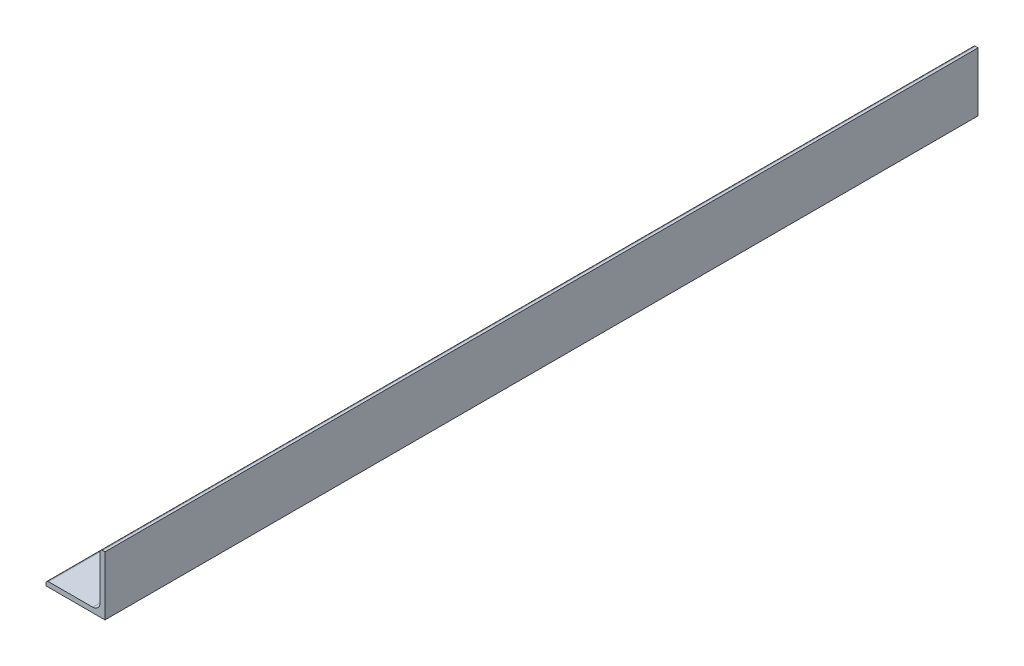
ISO-10303-21;
HEADER;
FILE_DESCRIPTION(('STEP AP214'),'2;1');
FILE_NAME('part.step','',(''),(''),'','','');
FILE_SCHEMA(('AUTOMOTIVE_DESIGN { 1 0 10303 214 1 1 1 1 }'));
ENDSEC;
DATA;
#1=APPLICATION_CONTEXT('core data for automotive mechanical design processes');
#2=APPLICATION_PROTOCOL_DEFINITION('international standard','automotive_design',2000,#1);
#3=PRODUCT_CONTEXT('',#1,'mechanical');
#4=PRODUCT('Part','Part','',(#3));
#5=PRODUCT_RELATED_PRODUCT_CATEGORY('part','',(#4));
#6=PRODUCT_DEFINITION_FORMATION('','',#4);
#7=PRODUCT_DEFINITION_CONTEXT('part definition',#1,'design');
#8=PRODUCT_DEFINITION('design','',#6,#7);
#9=PRODUCT_DEFINITION_SHAPE('','',#8);
#10=(LENGTH_UNIT() NAMED_UNIT(*) SI_UNIT(.MILLI.,.METRE.));
#11=(NAMED_UNIT(*) PLANE_ANGLE_UNIT() SI_UNIT($,.RADIAN.));
#12=(NAMED_UNIT(*) SI_UNIT($,.STERADIAN.) SOLID_ANGLE_UNIT());
#13=UNCERTAINTY_MEASURE_WITH_UNIT(LENGTH_MEASURE(1.E-05),#10,'distance_accuracy_value','');
#14=(GEOMETRIC_REPRESENTATION_CONTEXT(3) GLOBAL_UNCERTAINTY_ASSIGNED_CONTEXT((#13)) GLOBAL_UNIT_ASSIGNED_CONTEXT((#10,
#11,#12)) REPRESENTATION_CONTEXT('',''));
#15=CARTESIAN_POINT('',(0.,0.,0.));
#16=DIRECTION('',(0.,0.,1.));
#17=DIRECTION('',(1.,0.,0.));
#18=AXIS2_PLACEMENT_3D('',#15,#16,#17);
#19=CARTESIAN_POINT('',(-19.05,-17.4625,609.6));
#20=DIRECTION('',(1.,0.,0.));
#21=DIRECTION('',(0.,0.,-1.));
#22=AXIS2_PLACEMENT_3D('',#19,#20,#21);
#23=PLANE('',#22);
#24=DIRECTION('',(0.,0.,-1.));
#25=VECTOR('',#24,1.);
#26=CARTESIAN_POINT('',(-19.05,-17.4625,609.6));
#27=LINE('',#26,#25);
#28=CARTESIAN_POINT('',(-19.05,-17.4625,609.6));
#29=VERTEX_POINT('',#28);
#30=CARTESIAN_POINT('',(-19.05,-17.4625,45.6000000000004));
#31=VERTEX_POINT('',#30);
#32=EDGE_CURVE('E152',#29,#31,#27,.T.);
#33=ORIENTED_EDGE('',*,*,#32,.T.);
#34=DIRECTION('',(0.,-1.,0.));
#35=VECTOR('',#34,1.);
#36=CARTESIAN_POINT('',(-19.05,-17.4625000000002,45.6000000000002));
#37=LINE('',#36,#35);
#38=CARTESIAN_POINT('',(-19.05,-19.05,45.6000000000001));
#39=VERTEX_POINT('',#38);
#40=EDGE_CURVE('E57',#31,#39,#37,.T.);
#41=ORIENTED_EDGE('',*,*,#40,.T.);
#42=DIRECTION('',(0.,0.,-1.));
#43=VECTOR('',#42,1.);
#44=CARTESIAN_POINT('',(-19.05,-19.05,609.6));
#45=LINE('',#44,#43);
#46=CARTESIAN_POINT('',(-19.05,-19.05,609.6));
#47=VERTEX_POINT('',#46);
#48=EDGE_CURVE('E50',#47,#39,#45,.T.);
#49=ORIENTED_EDGE('',*,*,#48,.F.);
#50=DIRECTION('',(0.,-1.,0.));
#51=VECTOR('',#50,1.);
#52=CARTESIAN_POINT('',(-19.05,-17.4625,609.6));
#53=LINE('',#52,#51);
#54=EDGE_CURVE('E169',#29,#47,#53,.T.);
#55=ORIENTED_EDGE('',*,*,#54,.F.);
#56=EDGE_LOOP('',(#33,#41,#49,#55));
#57=FACE_BOUND('',#56,.T.);
#58=ADVANCED_FACE('F43',(#57),#23,.F.);
#59=CARTESIAN_POINT('',(-19.05,-19.05,609.6));
#60=DIRECTION('',(0.,1.,0.));
#61=DIRECTION('',(-1.,0.,0.));
#62=AXIS2_PLACEMENT_3D('',#59,#60,#61);
#63=PLANE('',#62);
#64=ORIENTED_EDGE('',*,*,#48,.T.);
#65=DIRECTION('',(1.,0.,0.));
#66=VECTOR('',#65,1.);
#67=CARTESIAN_POINT('',(-40.95,-19.05,45.6000000000001));
#68=LINE('',#67,#66);
#69=CARTESIAN_POINT('',(19.05,-19.05,45.6000000000001));
#70=VERTEX_POINT('',#69);
#71=EDGE_CURVE('E114',#39,#70,#68,.T.);
#72=ORIENTED_EDGE('',*,*,#71,.T.);
#73=DIRECTION('',(0.,0.,-1.));
#74=VECTOR('',#73,1.);
#75=CARTESIAN_POINT('',(19.05,-19.05,609.6));
#76=LINE('',#75,#74);
#77=CARTESIAN_POINT('',(19.05,-19.05,609.6));
#78=VERTEX_POINT('',#77);
#79=EDGE_CURVE('E126',#78,#70,#76,.T.);
#80=ORIENTED_EDGE('',*,*,#79,.F.);
#81=DIRECTION('',(1.,0.,0.));
#82=VECTOR('',#81,1.);
#83=CARTESIAN_POINT('',(-19.05,-19.05,609.6));
#84=LINE('',#83,#82);
#85=EDGE_CURVE('E167',#47,#78,#84,.T.);
#86=ORIENTED_EDGE('',*,*,#85,.F.);
#87=EDGE_LOOP('',(#64,#72,#80,#86));
#88=FACE_BOUND('',#87,.T.);
#89=ADVANCED_FACE('F125',(#88),#63,.F.);
#90=CARTESIAN_POINT('',(19.05,-19.05,609.6));
#91=DIRECTION('',(-1.,0.,0.));
#92=DIRECTION('',(0.,-1.,0.));
#93=AXIS2_PLACEMENT_3D('',#90,#91,#92);
#94=PLANE('',#93);
#95=ORIENTED_EDGE('',*,*,#79,.T.);
#96=DIRECTION('',(0.,-1.,0.));
#97=VECTOR('',#96,1.);
#98=CARTESIAN_POINT('',(19.05,19.0499999999999,45.6000000000001));
#99=LINE('',#98,#97);
#100=CARTESIAN_POINT('',(19.05,19.0499999999999,45.6000000000001));
#101=VERTEX_POINT('',#100);
#102=EDGE_CURVE('E111',#101,#70,#99,.T.);
#103=ORIENTED_EDGE('',*,*,#102,.F.);
#104=DIRECTION('',(0.,0.,-1.));
#105=VECTOR('',#104,1.);
#106=CARTESIAN_POINT('',(19.05,19.05,609.6));
#107=LINE('',#106,#105);
#108=CARTESIAN_POINT('',(19.05,19.05,609.6));
#109=VERTEX_POINT('',#108);
#110=EDGE_CURVE('E133',#109,#101,#107,.T.);
#111=ORIENTED_EDGE('',*,*,#110,.F.);
#112=DIRECTION('',(0.,1.,0.));
#113=VECTOR('',#112,1.);
#114=CARTESIAN_POINT('',(19.05,-19.05,609.6));
#115=LINE('',#114,#113);
#116=EDGE_CURVE('E132',#78,#109,#115,.T.);
#117=ORIENTED_EDGE('',*,*,#116,.F.);
#118=EDGE_LOOP('',(#95,#103,#111,#117));
#119=FACE_BOUND('',#118,.T.);
#120=ADVANCED_FACE('F131',(#119),#94,.F.);
#121=CARTESIAN_POINT('',(17.4625,19.05,609.6));
#122=DIRECTION('',(0.,-1.,0.));
#123=DIRECTION('',(1.,0.,0.));
#124=AXIS2_PLACEMENT_3D('',#121,#122,#123);
#125=PLANE('',#124);
#126=ORIENTED_EDGE('',*,*,#110,.T.);
#127=DIRECTION('',(1.,0.,0.));
#128=VECTOR('',#127,1.);
#129=CARTESIAN_POINT('',(-40.95,19.0499999999999,45.6000000000001));
#130=LINE('',#129,#128);
#131=CARTESIAN_POINT('',(17.4625,19.0499999999999,45.6000000000001));
#132=VERTEX_POINT('',#131);
#133=EDGE_CURVE('E116',#132,#101,#130,.T.);
#134=ORIENTED_EDGE('',*,*,#133,.F.);
#135=DIRECTION('',(0.,0.,-1.));
#136=VECTOR('',#135,1.);
#137=CARTESIAN_POINT('',(17.4625,19.05,609.6));
#138=LINE('',#137,#136);
#139=CARTESIAN_POINT('',(17.4625,19.05,609.6));
#140=VERTEX_POINT('',#139);
#141=EDGE_CURVE('E135',#140,#132,#138,.T.);
#142=ORIENTED_EDGE('',*,*,#141,.F.);
#143=DIRECTION('',(-1.,0.,0.));
#144=VECTOR('',#143,1.);
#145=CARTESIAN_POINT('',(17.4625,19.05,609.6));
#146=LINE('',#145,#144);
#147=EDGE_CURVE('E164',#109,#140,#146,.T.);
#148=ORIENTED_EDGE('',*,*,#147,.F.);
#149=EDGE_LOOP('',(#126,#134,#142,#148));
#150=FACE_BOUND('',#149,.T.);
#151=ADVANCED_FACE('F196',(#150),#125,.F.);
#152=CARTESIAN_POINT('',(17.4625,17.4625,609.6));
#153=DIRECTION('',(0.,0.,-1.));
#154=DIRECTION('',(-1.,0.,0.));
#155=AXIS2_PLACEMENT_3D('',#152,#153,#154);
#156=CYLINDRICAL_SURFACE('',#155,1.5875);
#157=ORIENTED_EDGE('',*,*,#141,.T.);
#158=CARTESIAN_POINT('',(17.4625,17.4625,45.6000000000002));
#159=DIRECTION('',(0.,0.,1.));
#160=DIRECTION('',(0.,-1.,0.));
#161=AXIS2_PLACEMENT_3D('',#158,#159,#160);
#162=CIRCLE('',#161,1.5875);
#163=CARTESIAN_POINT('',(15.875,17.4625,45.6000000000001));
#164=VERTEX_POINT('',#163);
#165=EDGE_CURVE('E172',#132,#164,#162,.T.);
#166=ORIENTED_EDGE('',*,*,#165,.T.);
#167=DIRECTION('',(0.,0.,-1.));
#168=VECTOR('',#167,1.);
#169=CARTESIAN_POINT('',(15.875,17.4625,609.6));
#170=LINE('',#169,#168);
#171=CARTESIAN_POINT('',(15.875,17.4625,609.6));
#172=VERTEX_POINT('',#171);
#173=EDGE_CURVE('E140',#172,#164,#170,.T.);
#174=ORIENTED_EDGE('',*,*,#173,.F.);
#175=CARTESIAN_POINT('',(17.4625,17.4625,609.6));
#176=DIRECTION('',(0.,0.,1.));
#177=DIRECTION('',(-1.,0.,0.));
#178=AXIS2_PLACEMENT_3D('',#175,#176,#177);
#179=CIRCLE('',#178,1.5875);
#180=EDGE_CURVE('E162',#140,#172,#179,.T.);
#181=ORIENTED_EDGE('',*,*,#180,.F.);
#182=EDGE_LOOP('',(#157,#166,#174,#181));
#183=FACE_BOUND('',#182,.T.);
#184=ADVANCED_FACE('F200',(#183),#156,.T.);
#185=CARTESIAN_POINT('',(15.875,17.4625,609.6));
#186=DIRECTION('',(1.,0.,0.));
#187=DIRECTION('',(0.,1.,0.));
#188=AXIS2_PLACEMENT_3D('',#185,#186,#187);
#189=PLANE('',#188);
#190=ORIENTED_EDGE('',*,*,#173,.T.);
#191=DIRECTION('',(0.,-1.,0.));
#192=VECTOR('',#191,1.);
#193=CARTESIAN_POINT('',(15.875,17.4624999999998,45.6000000000001));
#194=LINE('',#193,#192);
#195=CARTESIAN_POINT('',(15.875,-11.0998,45.6000000000002));
#196=VERTEX_POINT('',#195);
#197=EDGE_CURVE('E175',#164,#196,#194,.T.);
#198=ORIENTED_EDGE('',*,*,#197,.T.);
#199=DIRECTION('',(0.,0.,-1.));
#200=VECTOR('',#199,1.);
#201=CARTESIAN_POINT('',(15.875,-11.0998,609.6));
#202=LINE('',#201,#200);
#203=CARTESIAN_POINT('',(15.875,-11.0998,609.6));
#204=VERTEX_POINT('',#203);
#205=EDGE_CURVE('E143',#204,#196,#202,.T.);
#206=ORIENTED_EDGE('',*,*,#205,.F.);
#207=DIRECTION('',(0.,-1.,0.));
#208=VECTOR('',#207,1.);
#209=CARTESIAN_POINT('',(15.875,17.4625,609.6));
#210=LINE('',#209,#208);
#211=EDGE_CURVE('E160',#172,#204,#210,.T.);
#212=ORIENTED_EDGE('',*,*,#211,.F.);
#213=EDGE_LOOP('',(#190,#198,#206,#212));
#214=FACE_BOUND('',#213,.T.);
#215=ADVANCED_FACE('F205',(#214),#189,.F.);
#216=CARTESIAN_POINT('',(11.0998,-11.0998,609.6));
#217=DIRECTION('',(0.,0.,-1.));
#218=DIRECTION('',(-1.,0.,0.));
#219=AXIS2_PLACEMENT_3D('',#216,#217,#218);
#220=CYLINDRICAL_SURFACE('',#219,4.7752);
#221=ORIENTED_EDGE('',*,*,#205,.T.);
#222=CARTESIAN_POINT('',(11.0998,-11.0998,45.6000000000002));
#223=DIRECTION('',(0.,0.,1.));
#224=DIRECTION('',(0.,-1.,0.));
#225=AXIS2_PLACEMENT_3D('',#222,#223,#224);
#226=CIRCLE('',#225,4.7752);
#227=CARTESIAN_POINT('',(11.0998,-15.875,45.6000000000002));
#228=VERTEX_POINT('',#227);
#229=EDGE_CURVE('E178',#196,#228,#226,.F.);
#230=ORIENTED_EDGE('',*,*,#229,.T.);
#231=DIRECTION('',(0.,0.,-1.));
#232=VECTOR('',#231,1.);
#233=CARTESIAN_POINT('',(11.0998,-15.875,609.6));
#234=LINE('',#233,#232);
#235=CARTESIAN_POINT('',(11.0998,-15.875,609.6));
#236=VERTEX_POINT('',#235);
#237=EDGE_CURVE('E146',#236,#228,#234,.T.);
#238=ORIENTED_EDGE('',*,*,#237,.F.);
#239=CARTESIAN_POINT('',(11.0998,-11.0998,609.6));
#240=DIRECTION('',(0.,0.,-1.));
#241=DIRECTION('',(-1.,0.,0.));
#242=AXIS2_PLACEMENT_3D('',#239,#240,#241);
#243=CIRCLE('',#242,4.7752);
#244=EDGE_CURVE('E158',#204,#236,#243,.T.);
#245=ORIENTED_EDGE('',*,*,#244,.F.);
#246=EDGE_LOOP('',(#221,#230,#238,#245));
#247=FACE_BOUND('',#246,.T.);
#248=ADVANCED_FACE('F207',(#247),#220,.F.);
#249=CARTESIAN_POINT('',(11.0998,-15.875,609.6));
#250=DIRECTION('',(0.,-1.,0.));
#251=DIRECTION('',(1.,0.,0.));
#252=AXIS2_PLACEMENT_3D('',#249,#250,#251);
#253=PLANE('',#252);
#254=ORIENTED_EDGE('',*,*,#237,.T.);
#255=DIRECTION('',(-1.,0.,0.));
#256=VECTOR('',#255,1.);
#257=CARTESIAN_POINT('',(11.0998,-15.875,45.6000000000002));
#258=LINE('',#257,#256);
#259=CARTESIAN_POINT('',(-17.4625,-15.875,45.6000000000002));
#260=VERTEX_POINT('',#259);
#261=EDGE_CURVE('E129',#228,#260,#258,.T.);
#262=ORIENTED_EDGE('',*,*,#261,.T.);
#263=DIRECTION('',(0.,0.,-1.));
#264=VECTOR('',#263,1.);
#265=CARTESIAN_POINT('',(-17.4625,-15.875,609.6));
#266=LINE('',#265,#264);
#267=CARTESIAN_POINT('',(-17.4625,-15.875,609.6));
#268=VERTEX_POINT('',#267);
#269=EDGE_CURVE('E149',#268,#260,#266,.T.);
#270=ORIENTED_EDGE('',*,*,#269,.F.);
#271=DIRECTION('',(-1.,0.,0.));
#272=VECTOR('',#271,1.);
#273=CARTESIAN_POINT('',(11.0998,-15.875,609.6));
#274=LINE('',#273,#272);
#275=EDGE_CURVE('E156',#236,#268,#274,.T.);
#276=ORIENTED_EDGE('',*,*,#275,.F.);
#277=EDGE_LOOP('',(#254,#262,#270,#276));
#278=FACE_BOUND('',#277,.T.);
#279=ADVANCED_FACE('F185',(#278),#253,.F.);
#280=CARTESIAN_POINT('',(-17.4625,-17.4625,609.6));
#281=DIRECTION('',(0.,0.,-1.));
#282=DIRECTION('',(-1.,0.,0.));
#283=AXIS2_PLACEMENT_3D('',#280,#281,#282);
#284=CYLINDRICAL_SURFACE('',#283,1.5875);
#285=ORIENTED_EDGE('',*,*,#269,.T.);
#286=CARTESIAN_POINT('',(-17.4625,-17.4625,45.6000000000002));
#287=DIRECTION('',(0.,0.,1.));
#288=DIRECTION('',(0.,-1.,0.));
#289=AXIS2_PLACEMENT_3D('',#286,#287,#288);
#290=CIRCLE('',#289,1.5875);
#291=EDGE_CURVE('E11',#260,#31,#290,.T.);
#292=ORIENTED_EDGE('',*,*,#291,.T.);
#293=ORIENTED_EDGE('',*,*,#32,.F.);
#294=CARTESIAN_POINT('',(-17.4625,-17.4625,609.6));
#295=DIRECTION('',(0.,0.,1.));
#296=DIRECTION('',(-1.,0.,0.));
#297=AXIS2_PLACEMENT_3D('',#294,#295,#296);
#298=CIRCLE('',#297,1.5875);
#299=EDGE_CURVE('E64',#268,#29,#298,.T.);
#300=ORIENTED_EDGE('',*,*,#299,.F.);
#301=EDGE_LOOP('',(#285,#292,#293,#300));
#302=FACE_BOUND('',#301,.T.);
#303=ADVANCED_FACE('F189',(#302),#284,.T.);
#304=CARTESIAN_POINT('',(17.4625,17.4625,609.6));
#305=DIRECTION('',(0.,0.,-1.));
#306=DIRECTION('',(-1.,0.,0.));
#307=AXIS2_PLACEMENT_3D('',#304,#305,#306);
#308=PLANE('',#307);
#309=ORIENTED_EDGE('',*,*,#54,.T.);
#310=ORIENTED_EDGE('',*,*,#85,.T.);
#311=ORIENTED_EDGE('',*,*,#116,.T.);
#312=ORIENTED_EDGE('',*,*,#147,.T.);
#313=ORIENTED_EDGE('',*,*,#180,.T.);
#314=ORIENTED_EDGE('',*,*,#211,.T.);
#315=ORIENTED_EDGE('',*,*,#244,.T.);
#316=ORIENTED_EDGE('',*,*,#275,.T.);
#317=ORIENTED_EDGE('',*,*,#299,.T.);
#318=EDGE_LOOP('',(#309,#310,#311,#312,#313,#314,#315,#316,#317));
#319=FACE_BOUND('',#318,.T.);
#320=ADVANCED_FACE('F192',(#319),#308,.F.);
#321=CARTESIAN_POINT('',(-40.95,19.0499999999999,45.6000000000001));
#322=DIRECTION('',(0.,0.,1.));
#323=DIRECTION('',(0.,-1.,0.));
#324=AXIS2_PLACEMENT_3D('',#321,#322,#323);
#325=PLANE('',#324);
#326=ORIENTED_EDGE('',*,*,#291,.F.);
#327=ORIENTED_EDGE('',*,*,#261,.F.);
#328=ORIENTED_EDGE('',*,*,#229,.F.);
#329=ORIENTED_EDGE('',*,*,#197,.F.);
#330=ORIENTED_EDGE('',*,*,#165,.F.);
#331=ORIENTED_EDGE('',*,*,#133,.T.);
#332=ORIENTED_EDGE('',*,*,#102,.T.);
#333=ORIENTED_EDGE('',*,*,#71,.F.);
#334=ORIENTED_EDGE('',*,*,#40,.F.);
#335=EDGE_LOOP('',(#326,#327,#328,#329,#330,#331,#332,#333,#334));
#336=FACE_BOUND('',#335,.T.);
#337=ADVANCED_FACE('F113',(#336),#325,.F.);
#338=CLOSED_SHELL('',(#58,#89,#120,#151,#184,#215,#248,#279,#303,#320,#337));
#339=MANIFOLD_SOLID_BREP('B2',#338);
#340=ADVANCED_BREP_SHAPE_REPRESENTATION('',(#18,#339),#14);
#341=SHAPE_DEFINITION_REPRESENTATION(#9,#340);
ENDSEC;
END-ISO-10303-21;
